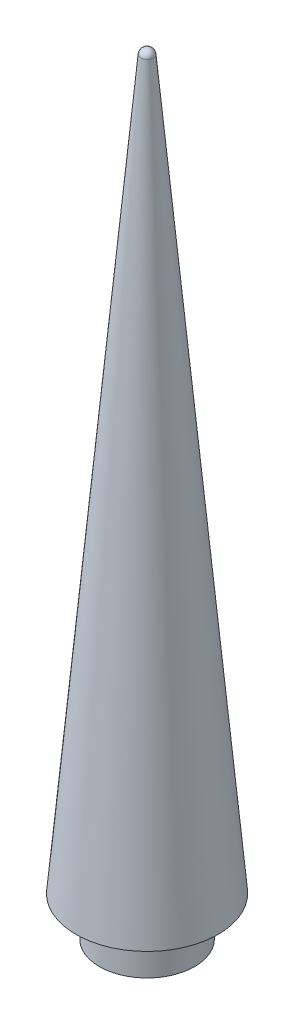
ISO-10303-21;
HEADER;
FILE_DESCRIPTION(('STEP AP214'),'2;1');
FILE_NAME('part.step','',(''),(''),'','','');
FILE_SCHEMA(('AUTOMOTIVE_DESIGN { 1 0 10303 214 1 1 1 1 }'));
ENDSEC;
DATA;
#1=APPLICATION_CONTEXT('core data for automotive mechanical design processes');
#2=APPLICATION_PROTOCOL_DEFINITION('international standard','automotive_design',2000,#1);
#3=PRODUCT_CONTEXT('',#1,'mechanical');
#4=PRODUCT('Part','Part','',(#3));
#5=PRODUCT_RELATED_PRODUCT_CATEGORY('part','',(#4));
#6=PRODUCT_DEFINITION_FORMATION('','',#4);
#7=PRODUCT_DEFINITION_CONTEXT('part definition',#1,'design');
#8=PRODUCT_DEFINITION('design','',#6,#7);
#9=PRODUCT_DEFINITION_SHAPE('','',#8);
#10=(LENGTH_UNIT() NAMED_UNIT(*) SI_UNIT(.MILLI.,.METRE.));
#11=(NAMED_UNIT(*) PLANE_ANGLE_UNIT() SI_UNIT($,.RADIAN.));
#12=(NAMED_UNIT(*) SI_UNIT($,.STERADIAN.) SOLID_ANGLE_UNIT());
#13=UNCERTAINTY_MEASURE_WITH_UNIT(LENGTH_MEASURE(1.E-05),#10,'distance_accuracy_value','');
#14=(GEOMETRIC_REPRESENTATION_CONTEXT(3) GLOBAL_UNCERTAINTY_ASSIGNED_CONTEXT((#13)) GLOBAL_UNIT_ASSIGNED_CONTEXT((#10,
#11,#12)) REPRESENTATION_CONTEXT('',''));
#15=CARTESIAN_POINT('',(0.,0.,0.));
#16=DIRECTION('',(0.,0.,1.));
#17=DIRECTION('',(1.,0.,0.));
#18=AXIS2_PLACEMENT_3D('',#15,#16,#17);
#19=CARTESIAN_POINT('',(0.,-6.35,0.));
#20=DIRECTION('',(0.,1.,0.));
#21=DIRECTION('',(0.,0.,1.));
#22=AXIS2_PLACEMENT_3D('',#19,#20,#21);
#23=CYLINDRICAL_SURFACE('',#22,7.62);
#24=CARTESIAN_POINT('',(0.,-6.35,0.));
#25=DIRECTION('',(0.,1.,0.));
#26=DIRECTION('',(0.,0.,1.));
#27=AXIS2_PLACEMENT_3D('',#24,#25,#26);
#28=CIRCLE('',#27,7.62);
#29=CARTESIAN_POINT('',(0.,-6.35,7.62));
#30=VERTEX_POINT('',#29);
#31=EDGE_CURVE('E11',#30,#30,#28,.T.);
#32=ORIENTED_EDGE('',*,*,#31,.T.);
#33=EDGE_LOOP('',(#32));
#34=FACE_BOUND('',#33,.T.);
#35=CARTESIAN_POINT('',(0.,0.,0.));
#36=DIRECTION('',(0.,1.,0.));
#37=DIRECTION('',(0.,0.,1.));
#38=AXIS2_PLACEMENT_3D('',#35,#36,#37);
#39=CIRCLE('',#38,7.62);
#40=CARTESIAN_POINT('',(0.,0.,7.62));
#41=VERTEX_POINT('',#40);
#42=EDGE_CURVE('E50',#41,#41,#39,.T.);
#43=ORIENTED_EDGE('',*,*,#42,.F.);
#44=EDGE_LOOP('',(#43));
#45=FACE_BOUND('',#44,.T.);
#46=ADVANCED_FACE('F47',(#34,#45),#23,.T.);
#47=CARTESIAN_POINT('',(0.,-6.35,0.));
#48=DIRECTION('',(0.,1.,0.));
#49=DIRECTION('',(0.,0.,1.));
#50=AXIS2_PLACEMENT_3D('',#47,#48,#49);
#51=PLANE('',#50);
#52=CARTESIAN_POINT('',(0.,-6.35,0.));
#53=DIRECTION('',(0.,-1.,0.));
#54=DIRECTION('',(0.,0.,-1.));
#55=AXIS2_PLACEMENT_3D('',#52,#53,#54);
#56=CIRCLE('',#55,1.35255);
#57=CARTESIAN_POINT('',(0.,-6.35,-1.35255));
#58=VERTEX_POINT('',#57);
#59=EDGE_CURVE('E70',#58,#58,#56,.T.);
#60=ORIENTED_EDGE('',*,*,#59,.F.);
#61=EDGE_LOOP('',(#60));
#62=FACE_BOUND('',#61,.T.);
#63=ORIENTED_EDGE('',*,*,#31,.F.);
#64=EDGE_LOOP('',(#63));
#65=FACE_BOUND('',#64,.T.);
#66=ADVANCED_FACE('F89',(#62,#65),#51,.F.);
#67=CARTESIAN_POINT('',(0.,116.280968605355,0.));
#68=DIRECTION('',(0.,-1.,0.));
#69=DIRECTION('',(0.,0.,-1.));
#70=AXIS2_PLACEMENT_3D('',#67,#68,#69);
#71=CONICAL_SURFACE('',#70,1.01197642698519,0.0890261343754949);
#72=CARTESIAN_POINT('',(0.,0.,0.));
#73=DIRECTION('',(0.,-1.,0.));
#74=DIRECTION('',(0.,0.,-1.));
#75=AXIS2_PLACEMENT_3D('',#72,#73,#74);
#76=CIRCLE('',#75,11.3914574500546);
#77=CARTESIAN_POINT('',(0.,0.,-11.3914574500546));
#78=VERTEX_POINT('',#77);
#79=EDGE_CURVE('E69',#78,#78,#76,.T.);
#80=CARTESIAN_POINT('',(0.,116.280968605355,0.));
#81=DIRECTION('',(0.,-1.,0.));
#82=DIRECTION('',(0.,0.,-1.));
#83=AXIS2_PLACEMENT_3D('',#80,#81,#82);
#84=CIRCLE('',#83,1.01197642698519);
#85=CARTESIAN_POINT('',(0.,116.280968605355,-1.01197642698519));
#86=VERTEX_POINT('',#85);
#87=EDGE_CURVE('E74',#86,#86,#84,.T.);
#88=CARTESIAN_POINT('',(0.,0.,-11.3914574500546));
#89=CARTESIAN_POINT('',(0.,1.21126008963911,-11.2833378560643));
#90=CARTESIAN_POINT('',(0.,2.42252017927822,-11.175218262074));
#91=CARTESIAN_POINT('',(0.,4.84504035855645,-10.9589790740934));
#92=CARTESIAN_POINT('',(0.,6.05630044819556,-10.8508594801031));
#93=CARTESIAN_POINT('',(0.,8.47882062747378,-10.6346202921225));
#94=CARTESIAN_POINT('',(0.,9.6900807171129,-10.5265006981322));
#95=CARTESIAN_POINT('',(0.,12.1126008963911,-10.3102615101515));
#96=CARTESIAN_POINT('',(0.,13.3238609860302,-10.2021419161612));
#97=CARTESIAN_POINT('',(0.,15.7463811653085,-9.98590272818062));
#98=CARTESIAN_POINT('',(0.,16.9576412549476,-9.87778313419031));
#99=CARTESIAN_POINT('',(0.,19.3801614342258,-9.6615439462097));
#100=CARTESIAN_POINT('',(0.,20.5914215238649,-9.5534243522194));
#101=CARTESIAN_POINT('',(0.,23.0139417031431,-9.33718516423878));
#102=CARTESIAN_POINT('',(0.,24.2252017927822,-9.22906557024848));
#103=CARTESIAN_POINT('',(0.,26.6477219720605,-9.01282638226786));
#104=CARTESIAN_POINT('',(0.,27.8589820616996,-8.90470678827756));
#105=CARTESIAN_POINT('',(0.,30.2815022409778,-8.68846760029694));
#106=CARTESIAN_POINT('',(0.,31.4927623306169,-8.58034800630664));
#107=CARTESIAN_POINT('',(0.,33.9152825098951,-8.36410881832602));
#108=CARTESIAN_POINT('',(0.,35.1265425995342,-8.25598922433572));
#109=CARTESIAN_POINT('',(0.,37.5490627788125,-8.03975003635511));
#110=CARTESIAN_POINT('',(0.,38.7603228684516,-7.9316304423648));
#111=CARTESIAN_POINT('',(0.,41.1828430477298,-7.71539125438419));
#112=CARTESIAN_POINT('',(0.,42.3941031373689,-7.60727166039388));
#113=CARTESIAN_POINT('',(0.,44.8166233166471,-7.39103247241327));
#114=CARTESIAN_POINT('',(0.,46.0278834062863,-7.28291287842296));
#115=CARTESIAN_POINT('',(0.,48.4504035855645,-7.06667369044235));
#116=CARTESIAN_POINT('',(0.,49.6616636752036,-6.95855409645204));
#117=CARTESIAN_POINT('',(0.,52.0841838544818,-6.74231490847143));
#118=CARTESIAN_POINT('',(0.,53.2954439441209,-6.63419531448112));
#119=CARTESIAN_POINT('',(0.,55.7179641233992,-6.41795612650051));
#120=CARTESIAN_POINT('',(0.,56.9292242130383,-6.3098365325102));
#121=CARTESIAN_POINT('',(0.,59.3517443923165,-6.09359734452959));
#122=CARTESIAN_POINT('',(0.,60.5630044819556,-5.98547775053928));
#123=CARTESIAN_POINT('',(0.,62.9855246612338,-5.76923856255867));
#124=CARTESIAN_POINT('',(0.,64.1967847508729,-5.66111896856837));
#125=CARTESIAN_POINT('',(0.,66.6193049301512,-5.44487978058775));
#126=CARTESIAN_POINT('',(0.,67.8305650197903,-5.33676018659745));
#127=CARTESIAN_POINT('',(0.,70.2530851990685,-5.12052099861683));
#128=CARTESIAN_POINT('',(0.,71.4643452887076,-5.01240140462653));
#129=CARTESIAN_POINT('',(0.,73.8868654679858,-4.79616221664591));
#130=CARTESIAN_POINT('',(0.,75.098125557625,-4.68804262265561));
#131=CARTESIAN_POINT('',(0.,77.5206457369032,-4.471803434675));
#132=CARTESIAN_POINT('',(0.,78.7319058265423,-4.36368384068469));
#133=CARTESIAN_POINT('',(0.,81.1544260058205,-4.14744465270407));
#134=CARTESIAN_POINT('',(0.,82.3656860954596,-4.03932505871377));
#135=CARTESIAN_POINT('',(0.,84.7882062747378,-3.82308587073316));
#136=CARTESIAN_POINT('',(0.,85.999466364377,-3.71496627674285));
#137=CARTESIAN_POINT('',(0.,88.4219865436552,-3.49872708876224));
#138=CARTESIAN_POINT('',(0.,89.6332466332943,-3.39060749477193));
#139=CARTESIAN_POINT('',(0.,92.0557668125725,-3.17436830679132));
#140=CARTESIAN_POINT('',(0.,93.2670269022116,-3.06624871280101));
#141=CARTESIAN_POINT('',(0.,95.6895470814898,-2.8500095248204));
#142=CARTESIAN_POINT('',(0.,96.900807171129,-2.74188993083009));
#143=CARTESIAN_POINT('',(0.,99.3233273504072,-2.52565074284948));
#144=CARTESIAN_POINT('',(0.,100.534587440046,-2.41753114885917));
#145=CARTESIAN_POINT('',(0.,102.957107619325,-2.20129196087856));
#146=CARTESIAN_POINT('',(0.,104.168367708964,-2.09317236688825));
#147=CARTESIAN_POINT('',(0.,106.590887888242,-1.87693317890764));
#148=CARTESIAN_POINT('',(0.,107.802147977881,-1.76881358491734));
#149=CARTESIAN_POINT('',(0.,110.224668157159,-1.55257439693672));
#150=CARTESIAN_POINT('',(0.,111.435928246798,-1.44445480294642));
#151=CARTESIAN_POINT('',(0.,113.858448426077,-1.2282156149658));
#152=CARTESIAN_POINT('',(0.,115.069708515716,-1.1200960209755));
#153=CARTESIAN_POINT('',(0.,116.280968605355,-1.01197642698519));
#154=B_SPLINE_CURVE_WITH_KNOTS('',3,(#88,#89,#90,#91,#92,#93,#94,#95,#96,#97,#98,#99,#100,#101,
#102,#103,#104,#105,#106,#107,#108,#109,#110,#111,#112,#113,#114,#115,#116,#117,#118,#119,#120,
#121,#122,#123,#124,#125,#126,#127,#128,#129,#130,#131,#132,#133,#134,#135,#136,#137,#138,#139,
#140,#141,#142,#143,#144,#145,#146,#147,#148,#149,#150,#151,#152,#153),.UNSPECIFIED.,.F.,.F.,(4,
2,2,2,2,2,2,2,2,2,2,2,2,2,2,2,2,2,2,2,2,2,2,2,2,2,2,2,2,2,2,2,4),(0.,3.64822801675205,
7.2964560335041,10.9446840502562,14.5929120670082,18.2411400837603,21.8893681005123,
25.5375961172644,29.1858241340164,32.8340521507685,36.4822801675205,40.1305081842725,
43.7787362010246,47.4269642177766,51.0751922345287,54.7234202512807,58.3716482680328,
62.0198762847848,65.6681043015369,69.3163323182889,72.964560335041,76.612788351793,
80.2610163685451,83.9092443852971,87.5574724020492,91.2057004188012,94.8539284355533,
98.5021564523053,102.150384469057,105.798612485809,109.446840502561,113.095068519314,
116.743296536066),.UNSPECIFIED.);
#155=EDGE_CURVE('BSEAM95',#78,#86,#154,.T.);
#156=ORIENTED_EDGE('',*,*,#79,.F.);
#157=ORIENTED_EDGE('',*,*,#87,.T.);
#158=ORIENTED_EDGE('',*,*,#155,.T.);
#159=ORIENTED_EDGE('',*,*,#155,.F.);
#160=EDGE_LOOP('',(#156,#158,#157,#159));
#161=FACE_BOUND('',#160,.T.);
#162=ADVANCED_FACE('F95',(#161),#71,.T.);
#163=CARTESIAN_POINT('',(0.,116.190637485433,0.));
#164=DIRECTION('',(0.,-1.,0.));
#165=DIRECTION('',(1.,0.,0.));
#166=AXIS2_PLACEMENT_3D('',#163,#164,#165);
#167=SPHERICAL_SURFACE('',#166,1.016);
#168=ORIENTED_EDGE('',*,*,#87,.F.);
#169=EDGE_LOOP('',(#168));
#170=FACE_BOUND('',#169,.T.);
#171=ADVANCED_FACE('F103',(#170),#167,.T.);
#172=CARTESIAN_POINT('',(0.,0.,0.));
#173=DIRECTION('',(0.,1.,0.));
#174=DIRECTION('',(0.,0.,1.));
#175=AXIS2_PLACEMENT_3D('',#172,#173,#174);
#176=PLANE('',#175);
#177=ORIENTED_EDGE('',*,*,#42,.T.);
#178=EDGE_LOOP('',(#177));
#179=FACE_BOUND('',#178,.T.);
#180=ORIENTED_EDGE('',*,*,#79,.T.);
#181=EDGE_LOOP('',(#180));
#182=FACE_BOUND('',#181,.T.);
#183=ADVANCED_FACE('F62',(#179,#182),#176,.F.);
#184=CARTESIAN_POINT('',(0.,3.048,0.));
#185=DIRECTION('',(0.,-1.,0.));
#186=DIRECTION('',(0.,0.,-1.));
#187=AXIS2_PLACEMENT_3D('',#184,#185,#186);
#188=CONICAL_SURFACE('',#187,1.35255,1.02974425867665);
#189=CARTESIAN_POINT('',(0.,3.86069403026573,0.));
#190=VERTEX_POINT('',#189);
#191=VERTEX_LOOP('',#190);
#192=FACE_BOUND('',#191,.T.);
#193=CARTESIAN_POINT('',(0.,3.048,0.));
#194=DIRECTION('',(0.,-1.,0.));
#195=DIRECTION('',(0.,0.,-1.));
#196=AXIS2_PLACEMENT_3D('',#193,#194,#195);
#197=CIRCLE('',#196,1.35255);
#198=CARTESIAN_POINT('',(0.,3.048,-1.35255));
#199=VERTEX_POINT('',#198);
#200=EDGE_CURVE('E66',#199,#199,#197,.T.);
#201=ORIENTED_EDGE('',*,*,#200,.T.);
#202=EDGE_LOOP('',(#201));
#203=FACE_BOUND('',#202,.T.);
#204=ADVANCED_FACE('F58',(#192,#203),#188,.F.);
#205=CARTESIAN_POINT('',(0.,-6.35,0.));
#206=DIRECTION('',(0.,-1.,0.));
#207=DIRECTION('',(0.,0.,-1.));
#208=AXIS2_PLACEMENT_3D('',#205,#206,#207);
#209=CYLINDRICAL_SURFACE('',#208,1.35255);
#210=ORIENTED_EDGE('',*,*,#200,.F.);
#211=EDGE_LOOP('',(#210));
#212=FACE_BOUND('',#211,.T.);
#213=ORIENTED_EDGE('',*,*,#59,.T.);
#214=EDGE_LOOP('',(#213));
#215=FACE_BOUND('',#214,.T.);
#216=ADVANCED_FACE('F61',(#212,#215),#209,.F.);
#217=CLOSED_SHELL('',(#46,#66,#162,#171,#183,#204,#216));
#218=MANIFOLD_SOLID_BREP('B2',#217);
#219=ADVANCED_BREP_SHAPE_REPRESENTATION('',(#18,#218),#14);
#220=SHAPE_DEFINITION_REPRESENTATION(#9,#219);
ENDSEC;
END-ISO-10303-21;
